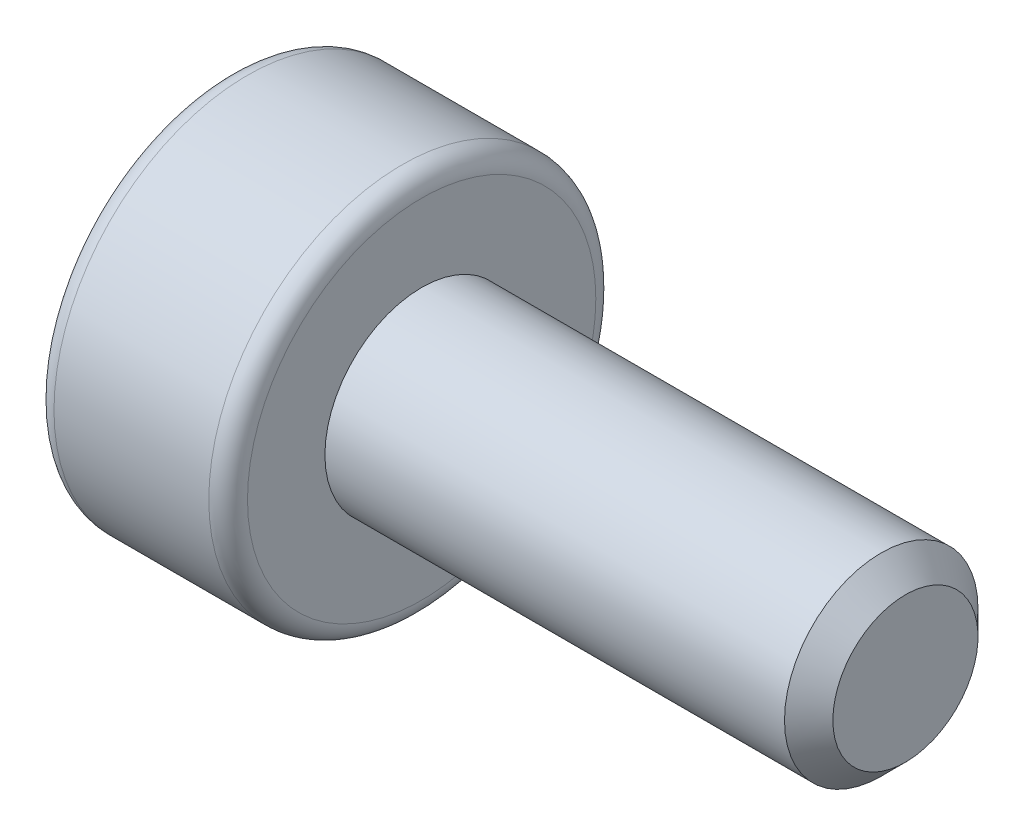
ISO-10303-21;
HEADER;
FILE_DESCRIPTION(('STEP AP214'),'2;1');
FILE_NAME('part.step','',(''),(''),'','','');
FILE_SCHEMA(('AUTOMOTIVE_DESIGN { 1 0 10303 214 1 1 1 1 }'));
ENDSEC;
DATA;
#1=APPLICATION_CONTEXT('core data for automotive mechanical design processes');
#2=APPLICATION_PROTOCOL_DEFINITION('international standard','automotive_design',2000,#1);
#3=PRODUCT_CONTEXT('',#1,'mechanical');
#4=PRODUCT('Part','Part','',(#3));
#5=PRODUCT_RELATED_PRODUCT_CATEGORY('part','',(#4));
#6=PRODUCT_DEFINITION_FORMATION('','',#4);
#7=PRODUCT_DEFINITION_CONTEXT('part definition',#1,'design');
#8=PRODUCT_DEFINITION('design','',#6,#7);
#9=PRODUCT_DEFINITION_SHAPE('','',#8);
#10=(LENGTH_UNIT() NAMED_UNIT(*) SI_UNIT(.MILLI.,.METRE.));
#11=(NAMED_UNIT(*) PLANE_ANGLE_UNIT() SI_UNIT($,.RADIAN.));
#12=(NAMED_UNIT(*) SI_UNIT($,.STERADIAN.) SOLID_ANGLE_UNIT());
#13=UNCERTAINTY_MEASURE_WITH_UNIT(LENGTH_MEASURE(1.E-05),#10,'distance_accuracy_value','');
#14=(GEOMETRIC_REPRESENTATION_CONTEXT(3) GLOBAL_UNCERTAINTY_ASSIGNED_CONTEXT((#13)) GLOBAL_UNIT_ASSIGNED_CONTEXT((#10,
#11,#12)) REPRESENTATION_CONTEXT('',''));
#15=CARTESIAN_POINT('',(0.,0.,0.));
#16=DIRECTION('',(0.,0.,1.));
#17=DIRECTION('',(1.,0.,0.));
#18=AXIS2_PLACEMENT_3D('',#15,#16,#17);
#19=CARTESIAN_POINT('',(0.,0.,0.));
#20=DIRECTION('',(1.,0.,0.));
#21=DIRECTION('',(0.,0.,-1.));
#22=AXIS2_PLACEMENT_3D('',#19,#20,#21);
#23=PLANE('',#22);
#24=DIRECTION('',(0.,0.866025403784439,0.5));
#25=VECTOR('',#24,1.);
#26=CARTESIAN_POINT('',(0.,-0.75,0.433012701892219));
#27=LINE('',#26,#25);
#28=CARTESIAN_POINT('',(0.,-0.75,0.433012701892219));
#29=VERTEX_POINT('',#28);
#30=CARTESIAN_POINT('',(0.,0.,0.866025403784438));
#31=VERTEX_POINT('',#30);
#32=EDGE_CURVE('E134',#29,#31,#27,.T.);
#33=ORIENTED_EDGE('',*,*,#32,.F.);
#34=DIRECTION('',(0.,0.,1.));
#35=VECTOR('',#34,1.);
#36=CARTESIAN_POINT('',(0.,-0.75,-0.43301270189222));
#37=LINE('',#36,#35);
#38=CARTESIAN_POINT('',(0.,-0.75,-0.43301270189222));
#39=VERTEX_POINT('',#38);
#40=EDGE_CURVE('E54',#39,#29,#37,.T.);
#41=ORIENTED_EDGE('',*,*,#40,.F.);
#42=DIRECTION('',(0.,-0.866025403784439,0.5));
#43=VECTOR('',#42,1.);
#44=CARTESIAN_POINT('',(0.,0.,-0.866025403784439));
#45=LINE('',#44,#43);
#46=CARTESIAN_POINT('',(0.,0.,-0.866025403784439));
#47=VERTEX_POINT('',#46);
#48=EDGE_CURVE('E147',#47,#39,#45,.T.);
#49=ORIENTED_EDGE('',*,*,#48,.F.);
#50=DIRECTION('',(0.,-0.866025403784439,-0.5));
#51=VECTOR('',#50,1.);
#52=CARTESIAN_POINT('',(0.,0.75,-0.43301270189222));
#53=LINE('',#52,#51);
#54=CARTESIAN_POINT('',(0.,0.75,-0.43301270189222));
#55=VERTEX_POINT('',#54);
#56=EDGE_CURVE('E144',#55,#47,#53,.T.);
#57=ORIENTED_EDGE('',*,*,#56,.F.);
#58=DIRECTION('',(0.,0.,-1.));
#59=VECTOR('',#58,1.);
#60=CARTESIAN_POINT('',(0.,0.75,0.433012701892219));
#61=LINE('',#60,#59);
#62=CARTESIAN_POINT('',(0.,0.75,0.433012701892219));
#63=VERTEX_POINT('',#62);
#64=EDGE_CURVE('E102',#63,#55,#61,.T.);
#65=ORIENTED_EDGE('',*,*,#64,.F.);
#66=DIRECTION('',(0.,0.866025403784439,-0.5));
#67=VECTOR('',#66,1.);
#68=CARTESIAN_POINT('',(0.,0.,0.866025403784438));
#69=LINE('',#68,#67);
#70=EDGE_CURVE('E138',#31,#63,#69,.T.);
#71=ORIENTED_EDGE('',*,*,#70,.F.);
#72=EDGE_LOOP('',(#33,#41,#49,#57,#65,#71));
#73=FACE_BOUND('',#72,.T.);
#74=CARTESIAN_POINT('',(0.,0.,0.));
#75=DIRECTION('',(-1.,0.,0.));
#76=DIRECTION('',(0.,0.,1.));
#77=AXIS2_PLACEMENT_3D('',#74,#75,#76);
#78=CIRCLE('',#77,1.8);
#79=CARTESIAN_POINT('',(0.,0.,1.8));
#80=VERTEX_POINT('',#79);
#81=EDGE_CURVE('E11',#80,#80,#78,.T.);
#82=ORIENTED_EDGE('',*,*,#81,.T.);
#83=EDGE_LOOP('',(#82));
#84=FACE_BOUND('',#83,.T.);
#85=ADVANCED_FACE('F39',(#73,#84),#23,.F.);
#86=CARTESIAN_POINT('',(0.2,0.,0.));
#87=DIRECTION('',(-1.,0.,0.));
#88=DIRECTION('',(0.,0.,1.));
#89=AXIS2_PLACEMENT_3D('',#86,#87,#88);
#90=TOROIDAL_SURFACE('',#89,1.8,0.2);
#91=ORIENTED_EDGE('',*,*,#81,.F.);
#92=EDGE_LOOP('',(#91));
#93=FACE_BOUND('',#92,.T.);
#94=CARTESIAN_POINT('',(0.200000000000001,0.,0.));
#95=DIRECTION('',(-1.,0.,0.));
#96=DIRECTION('',(0.,0.,1.));
#97=AXIS2_PLACEMENT_3D('',#94,#95,#96);
#98=CIRCLE('',#97,2.);
#99=CARTESIAN_POINT('',(0.200000000000001,0.,2.));
#100=VERTEX_POINT('',#99);
#101=EDGE_CURVE('E47',#100,#100,#98,.T.);
#102=ORIENTED_EDGE('',*,*,#101,.T.);
#103=EDGE_LOOP('',(#102));
#104=FACE_BOUND('',#103,.T.);
#105=ADVANCED_FACE('F185',(#93,#104),#90,.T.);
#106=CARTESIAN_POINT('',(-2.28184155946539,0.,0.));
#107=DIRECTION('',(-1.,0.,0.));
#108=DIRECTION('',(0.,0.,1.));
#109=AXIS2_PLACEMENT_3D('',#106,#107,#108);
#110=CYLINDRICAL_SURFACE('',#109,2.);
#111=ORIENTED_EDGE('',*,*,#101,.F.);
#112=EDGE_LOOP('',(#111));
#113=FACE_BOUND('',#112,.T.);
#114=CARTESIAN_POINT('',(1.8,0.,0.));
#115=DIRECTION('',(-1.,0.,0.));
#116=DIRECTION('',(0.,0.,1.));
#117=AXIS2_PLACEMENT_3D('',#114,#115,#116);
#118=CIRCLE('',#117,2.);
#119=CARTESIAN_POINT('',(1.8,0.,2.));
#120=VERTEX_POINT('',#119);
#121=EDGE_CURVE('E178',#120,#120,#118,.T.);
#122=ORIENTED_EDGE('',*,*,#121,.T.);
#123=EDGE_LOOP('',(#122));
#124=FACE_BOUND('',#123,.T.);
#125=ADVANCED_FACE('F187',(#113,#124),#110,.T.);
#126=CARTESIAN_POINT('',(1.8,0.,0.));
#127=DIRECTION('',(-1.,0.,0.));
#128=DIRECTION('',(0.,0.,1.));
#129=AXIS2_PLACEMENT_3D('',#126,#127,#128);
#130=TOROIDAL_SURFACE('',#129,1.8,0.2);
#131=ORIENTED_EDGE('',*,*,#121,.F.);
#132=EDGE_LOOP('',(#131));
#133=FACE_BOUND('',#132,.T.);
#134=CARTESIAN_POINT('',(2.,0.,0.));
#135=DIRECTION('',(-1.,0.,0.));
#136=DIRECTION('',(0.,0.,1.));
#137=AXIS2_PLACEMENT_3D('',#134,#135,#136);
#138=CIRCLE('',#137,1.8);
#139=CARTESIAN_POINT('',(2.,0.,1.8));
#140=VERTEX_POINT('',#139);
#141=EDGE_CURVE('E174',#140,#140,#138,.T.);
#142=ORIENTED_EDGE('',*,*,#141,.T.);
#143=EDGE_LOOP('',(#142));
#144=FACE_BOUND('',#143,.T.);
#145=ADVANCED_FACE('F190',(#133,#144),#130,.T.);
#146=CARTESIAN_POINT('',(2.,1.,0.));
#147=DIRECTION('',(-1.,0.,0.));
#148=DIRECTION('',(0.,0.,1.));
#149=AXIS2_PLACEMENT_3D('',#146,#147,#148);
#150=PLANE('',#149);
#151=ORIENTED_EDGE('',*,*,#141,.F.);
#152=EDGE_LOOP('',(#151));
#153=FACE_BOUND('',#152,.T.);
#154=CARTESIAN_POINT('',(2.,0.,0.));
#155=DIRECTION('',(-1.,0.,0.));
#156=DIRECTION('',(0.,0.,1.));
#157=AXIS2_PLACEMENT_3D('',#154,#155,#156);
#158=CIRCLE('',#157,1.);
#159=CARTESIAN_POINT('',(2.,0.,1.));
#160=VERTEX_POINT('',#159);
#161=EDGE_CURVE('E170',#160,#160,#158,.T.);
#162=ORIENTED_EDGE('',*,*,#161,.T.);
#163=EDGE_LOOP('',(#162));
#164=FACE_BOUND('',#163,.T.);
#165=ADVANCED_FACE('F196',(#153,#164),#150,.F.);
#166=CARTESIAN_POINT('',(-2.28184155946539,0.,0.));
#167=DIRECTION('',(-1.,0.,0.));
#168=DIRECTION('',(0.,0.,1.));
#169=AXIS2_PLACEMENT_3D('',#166,#167,#168);
#170=CYLINDRICAL_SURFACE('',#169,1.);
#171=ORIENTED_EDGE('',*,*,#161,.F.);
#172=EDGE_LOOP('',(#171));
#173=FACE_BOUND('',#172,.T.);
#174=CARTESIAN_POINT('',(6.75,0.,0.));
#175=DIRECTION('',(-1.,0.,0.));
#176=DIRECTION('',(0.,0.,1.));
#177=AXIS2_PLACEMENT_3D('',#174,#175,#176);
#178=CIRCLE('',#177,1.);
#179=CARTESIAN_POINT('',(6.75,0.,1.));
#180=VERTEX_POINT('',#179);
#181=EDGE_CURVE('E166',#180,#180,#178,.T.);
#182=ORIENTED_EDGE('',*,*,#181,.T.);
#183=EDGE_LOOP('',(#182));
#184=FACE_BOUND('',#183,.T.);
#185=ADVANCED_FACE('F202',(#173,#184),#170,.T.);
#186=CARTESIAN_POINT('',(7.,0.,0.));
#187=DIRECTION('',(-1.,0.,0.));
#188=DIRECTION('',(0.,0.,1.));
#189=AXIS2_PLACEMENT_3D('',#186,#187,#188);
#190=CONICAL_SURFACE('',#189,0.75,0.785398163397448);
#191=ORIENTED_EDGE('',*,*,#181,.F.);
#192=EDGE_LOOP('',(#191));
#193=FACE_BOUND('',#192,.T.);
#194=CARTESIAN_POINT('',(7.,0.,0.));
#195=DIRECTION('',(-1.,0.,0.));
#196=DIRECTION('',(0.,0.,1.));
#197=AXIS2_PLACEMENT_3D('',#194,#195,#196);
#198=CIRCLE('',#197,0.75);
#199=CARTESIAN_POINT('',(7.,0.,0.75));
#200=VERTEX_POINT('',#199);
#201=EDGE_CURVE('E153',#200,#200,#198,.T.);
#202=ORIENTED_EDGE('',*,*,#201,.T.);
#203=EDGE_LOOP('',(#202));
#204=FACE_BOUND('',#203,.T.);
#205=ADVANCED_FACE('F208',(#193,#204),#190,.T.);
#206=CARTESIAN_POINT('',(7.,0.75,0.));
#207=DIRECTION('',(-1.,0.,0.));
#208=DIRECTION('',(0.,0.,1.));
#209=AXIS2_PLACEMENT_3D('',#206,#207,#208);
#210=PLANE('',#209);
#211=ORIENTED_EDGE('',*,*,#201,.F.);
#212=EDGE_LOOP('',(#211));
#213=FACE_BOUND('',#212,.T.);
#214=ADVANCED_FACE('F214',(#213),#210,.F.);
#215=CARTESIAN_POINT('',(0.8,-0.75,-0.43301270189222));
#216=DIRECTION('',(0.,-1.,0.));
#217=DIRECTION('',(0.,0.,-1.));
#218=AXIS2_PLACEMENT_3D('',#215,#216,#217);
#219=PLANE('',#218);
#220=ORIENTED_EDGE('',*,*,#40,.T.);
#221=DIRECTION('',(-1.,0.,0.));
#222=VECTOR('',#221,1.);
#223=CARTESIAN_POINT('',(0.8,-0.75,0.433012701892219));
#224=LINE('',#223,#222);
#225=CARTESIAN_POINT('',(0.8,-0.75,0.433012701892219));
#226=VERTEX_POINT('',#225);
#227=EDGE_CURVE('E84',#226,#29,#224,.T.);
#228=ORIENTED_EDGE('',*,*,#227,.F.);
#229=DIRECTION('',(0.,0.,1.));
#230=VECTOR('',#229,1.);
#231=CARTESIAN_POINT('',(0.8,-0.75,-0.43301270189222));
#232=LINE('',#231,#230);
#233=CARTESIAN_POINT('',(0.8,-0.75,-0.43301270189222));
#234=VERTEX_POINT('',#233);
#235=EDGE_CURVE('E150',#234,#226,#232,.T.);
#236=ORIENTED_EDGE('',*,*,#235,.F.);
#237=DIRECTION('',(-1.,0.,0.));
#238=VECTOR('',#237,1.);
#239=CARTESIAN_POINT('',(0.8,-0.75,-0.43301270189222));
#240=LINE('',#239,#238);
#241=EDGE_CURVE('E62',#234,#39,#240,.T.);
#242=ORIENTED_EDGE('',*,*,#241,.T.);
#243=EDGE_LOOP('',(#220,#228,#236,#242));
#244=FACE_BOUND('',#243,.T.);
#245=ADVANCED_FACE('F219',(#244),#219,.F.);
#246=CARTESIAN_POINT('',(0.8,0.,-0.866025403784439));
#247=DIRECTION('',(0.,-0.5,-0.866025403784439));
#248=DIRECTION('',(0.,0.866025403784439,-0.5));
#249=AXIS2_PLACEMENT_3D('',#246,#247,#248);
#250=PLANE('',#249);
#251=ORIENTED_EDGE('',*,*,#48,.T.);
#252=ORIENTED_EDGE('',*,*,#241,.F.);
#253=DIRECTION('',(0.,-0.866025403784439,0.5));
#254=VECTOR('',#253,1.);
#255=CARTESIAN_POINT('',(0.8,0.,-0.866025403784439));
#256=LINE('',#255,#254);
#257=CARTESIAN_POINT('',(0.8,0.,-0.866025403784439));
#258=VERTEX_POINT('',#257);
#259=EDGE_CURVE('E116',#258,#234,#256,.T.);
#260=ORIENTED_EDGE('',*,*,#259,.F.);
#261=DIRECTION('',(-1.,0.,0.));
#262=VECTOR('',#261,1.);
#263=CARTESIAN_POINT('',(0.8,0.,-0.866025403784439));
#264=LINE('',#263,#262);
#265=EDGE_CURVE('E107',#258,#47,#264,.T.);
#266=ORIENTED_EDGE('',*,*,#265,.T.);
#267=EDGE_LOOP('',(#251,#252,#260,#266));
#268=FACE_BOUND('',#267,.T.);
#269=ADVANCED_FACE('F224',(#268),#250,.F.);
#270=CARTESIAN_POINT('',(0.8,0.75,-0.43301270189222));
#271=DIRECTION('',(0.,0.5,-0.866025403784439));
#272=DIRECTION('',(0.,0.866025403784439,0.5));
#273=AXIS2_PLACEMENT_3D('',#270,#271,#272);
#274=PLANE('',#273);
#275=ORIENTED_EDGE('',*,*,#56,.T.);
#276=ORIENTED_EDGE('',*,*,#265,.F.);
#277=DIRECTION('',(0.,-0.866025403784439,-0.5));
#278=VECTOR('',#277,1.);
#279=CARTESIAN_POINT('',(0.8,0.75,-0.43301270189222));
#280=LINE('',#279,#278);
#281=CARTESIAN_POINT('',(0.8,0.75,-0.43301270189222));
#282=VERTEX_POINT('',#281);
#283=EDGE_CURVE('E111',#282,#258,#280,.T.);
#284=ORIENTED_EDGE('',*,*,#283,.F.);
#285=DIRECTION('',(-1.,0.,0.));
#286=VECTOR('',#285,1.);
#287=CARTESIAN_POINT('',(0.8,0.75,-0.43301270189222));
#288=LINE('',#287,#286);
#289=EDGE_CURVE('E95',#282,#55,#288,.T.);
#290=ORIENTED_EDGE('',*,*,#289,.T.);
#291=EDGE_LOOP('',(#275,#276,#284,#290));
#292=FACE_BOUND('',#291,.T.);
#293=ADVANCED_FACE('F112',(#292),#274,.F.);
#294=CARTESIAN_POINT('',(0.8,0.75,0.433012701892219));
#295=DIRECTION('',(0.,1.,0.));
#296=DIRECTION('',(0.,0.,1.));
#297=AXIS2_PLACEMENT_3D('',#294,#295,#296);
#298=PLANE('',#297);
#299=ORIENTED_EDGE('',*,*,#64,.T.);
#300=ORIENTED_EDGE('',*,*,#289,.F.);
#301=DIRECTION('',(0.,0.,-1.));
#302=VECTOR('',#301,1.);
#303=CARTESIAN_POINT('',(0.8,0.75,0.433012701892219));
#304=LINE('',#303,#302);
#305=CARTESIAN_POINT('',(0.8,0.75,0.433012701892219));
#306=VERTEX_POINT('',#305);
#307=EDGE_CURVE('E99',#306,#282,#304,.T.);
#308=ORIENTED_EDGE('',*,*,#307,.F.);
#309=DIRECTION('',(-1.,0.,0.));
#310=VECTOR('',#309,1.);
#311=CARTESIAN_POINT('',(0.8,0.75,0.433012701892219));
#312=LINE('',#311,#310);
#313=EDGE_CURVE('E108',#306,#63,#312,.T.);
#314=ORIENTED_EDGE('',*,*,#313,.T.);
#315=EDGE_LOOP('',(#299,#300,#308,#314));
#316=FACE_BOUND('',#315,.T.);
#317=ADVANCED_FACE('F97',(#316),#298,.F.);
#318=CARTESIAN_POINT('',(0.8,0.,0.866025403784438));
#319=DIRECTION('',(0.,0.5,0.866025403784439));
#320=DIRECTION('',(0.,-0.866025403784439,0.5));
#321=AXIS2_PLACEMENT_3D('',#318,#319,#320);
#322=PLANE('',#321);
#323=ORIENTED_EDGE('',*,*,#70,.T.);
#324=ORIENTED_EDGE('',*,*,#313,.F.);
#325=DIRECTION('',(0.,0.866025403784439,-0.5));
#326=VECTOR('',#325,1.);
#327=CARTESIAN_POINT('',(0.8,0.,0.866025403784438));
#328=LINE('',#327,#326);
#329=CARTESIAN_POINT('',(0.8,0.,0.866025403784438));
#330=VERTEX_POINT('',#329);
#331=EDGE_CURVE('E122',#330,#306,#328,.T.);
#332=ORIENTED_EDGE('',*,*,#331,.F.);
#333=DIRECTION('',(-1.,0.,0.));
#334=VECTOR('',#333,1.);
#335=CARTESIAN_POINT('',(0.8,0.,0.866025403784438));
#336=LINE('',#335,#334);
#337=EDGE_CURVE('E158',#330,#31,#336,.T.);
#338=ORIENTED_EDGE('',*,*,#337,.T.);
#339=EDGE_LOOP('',(#323,#324,#332,#338));
#340=FACE_BOUND('',#339,.T.);
#341=ADVANCED_FACE('F252',(#340),#322,.F.);
#342=CARTESIAN_POINT('',(0.8,-0.75,0.433012701892219));
#343=DIRECTION('',(0.,-0.5,0.866025403784439));
#344=DIRECTION('',(0.,-0.866025403784439,-0.5));
#345=AXIS2_PLACEMENT_3D('',#342,#343,#344);
#346=PLANE('',#345);
#347=ORIENTED_EDGE('',*,*,#32,.T.);
#348=ORIENTED_EDGE('',*,*,#337,.F.);
#349=DIRECTION('',(0.,0.866025403784439,0.5));
#350=VECTOR('',#349,1.);
#351=CARTESIAN_POINT('',(0.8,-0.75,0.433012701892219));
#352=LINE('',#351,#350);
#353=EDGE_CURVE('E126',#226,#330,#352,.T.);
#354=ORIENTED_EDGE('',*,*,#353,.F.);
#355=ORIENTED_EDGE('',*,*,#227,.T.);
#356=EDGE_LOOP('',(#347,#348,#354,#355));
#357=FACE_BOUND('',#356,.T.);
#358=ADVANCED_FACE('F238',(#357),#346,.F.);
#359=CARTESIAN_POINT('',(0.8,0.,0.));
#360=DIRECTION('',(-1.,0.,0.));
#361=DIRECTION('',(0.,0.,1.));
#362=AXIS2_PLACEMENT_3D('',#359,#360,#361);
#363=PLANE('',#362);
#364=ORIENTED_EDGE('',*,*,#235,.T.);
#365=ORIENTED_EDGE('',*,*,#353,.T.);
#366=ORIENTED_EDGE('',*,*,#331,.T.);
#367=ORIENTED_EDGE('',*,*,#307,.T.);
#368=ORIENTED_EDGE('',*,*,#283,.T.);
#369=ORIENTED_EDGE('',*,*,#259,.T.);
#370=EDGE_LOOP('',(#364,#365,#366,#367,#368,#369));
#371=FACE_BOUND('',#370,.T.);
#372=ADVANCED_FACE('F119',(#371),#363,.T.);
#373=CLOSED_SHELL('',(#85,#105,#125,#145,#165,#185,#205,#214,#245,#269,#293,#317,#341,#358,#372));
#374=MANIFOLD_SOLID_BREP('B2',#373);
#375=ADVANCED_BREP_SHAPE_REPRESENTATION('',(#18,#374),#14);
#376=SHAPE_DEFINITION_REPRESENTATION(#9,#375);
ENDSEC;
END-ISO-10303-21;
